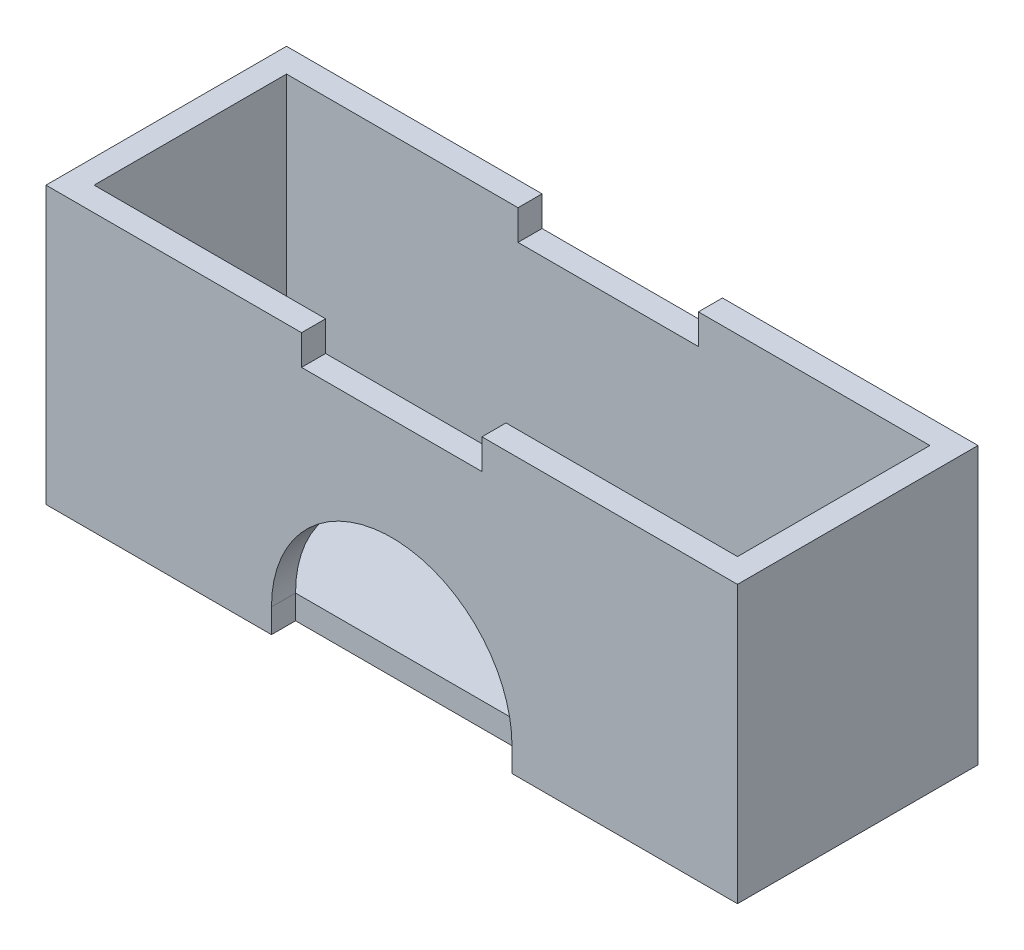
ISO-10303-21;
HEADER;
FILE_DESCRIPTION(('STEP AP214'),'2;1');
FILE_NAME('part.step','',(''),(''),'','','');
FILE_SCHEMA(('AUTOMOTIVE_DESIGN { 1 0 10303 214 1 1 1 1 }'));
ENDSEC;
DATA;
#1=APPLICATION_CONTEXT('core data for automotive mechanical design processes');
#2=APPLICATION_PROTOCOL_DEFINITION('international standard','automotive_design',2000,#1);
#3=PRODUCT_CONTEXT('',#1,'mechanical');
#4=PRODUCT('Part','Part','',(#3));
#5=PRODUCT_RELATED_PRODUCT_CATEGORY('part','',(#4));
#6=PRODUCT_DEFINITION_FORMATION('','',#4);
#7=PRODUCT_DEFINITION_CONTEXT('part definition',#1,'design');
#8=PRODUCT_DEFINITION('design','',#6,#7);
#9=PRODUCT_DEFINITION_SHAPE('','',#8);
#10=(LENGTH_UNIT() NAMED_UNIT(*) SI_UNIT(.MILLI.,.METRE.));
#11=(NAMED_UNIT(*) PLANE_ANGLE_UNIT() SI_UNIT($,.RADIAN.));
#12=(NAMED_UNIT(*) SI_UNIT($,.STERADIAN.) SOLID_ANGLE_UNIT());
#13=UNCERTAINTY_MEASURE_WITH_UNIT(LENGTH_MEASURE(1.E-05),#10,'distance_accuracy_value','');
#14=(GEOMETRIC_REPRESENTATION_CONTEXT(3) GLOBAL_UNCERTAINTY_ASSIGNED_CONTEXT((#13)) GLOBAL_UNIT_ASSIGNED_CONTEXT((#10,
#11,#12)) REPRESENTATION_CONTEXT('',''));
#15=CARTESIAN_POINT('',(0.,0.,0.));
#16=DIRECTION('',(0.,0.,1.));
#17=DIRECTION('',(1.,0.,0.));
#18=AXIS2_PLACEMENT_3D('',#15,#16,#17);
#19=CARTESIAN_POINT('',(0.,58.42,0.));
#20=DIRECTION('',(0.,-1.,0.));
#21=DIRECTION('',(0.,0.,-1.));
#22=AXIS2_PLACEMENT_3D('',#19,#20,#21);
#23=PLANE('',#22);
#24=DIRECTION('',(1.,0.,0.));
#25=VECTOR('',#24,1.);
#26=CARTESIAN_POINT('',(0.,58.42,0.));
#27=LINE('',#26,#25);
#28=CARTESIAN_POINT('',(0.,58.42,0.));
#29=VERTEX_POINT('',#28);
#30=CARTESIAN_POINT('',(53.975,58.42,0.));
#31=VERTEX_POINT('',#30);
#32=EDGE_CURVE('E283',#29,#31,#27,.T.);
#33=ORIENTED_EDGE('',*,*,#32,.T.);
#34=DIRECTION('',(0.,0.,1.));
#35=VECTOR('',#34,1.);
#36=CARTESIAN_POINT('',(53.975,58.42,-50.8));
#37=LINE('',#36,#35);
#38=CARTESIAN_POINT('',(53.975,58.42,-5.08));
#39=VERTEX_POINT('',#38);
#40=EDGE_CURVE('E183',#39,#31,#37,.T.);
#41=ORIENTED_EDGE('',*,*,#40,.F.);
#42=DIRECTION('',(1.,0.,0.));
#43=VECTOR('',#42,1.);
#44=CARTESIAN_POINT('',(0.,58.42,-5.08));
#45=LINE('',#44,#43);
#46=CARTESIAN_POINT('',(5.08,58.42,-5.08));
#47=VERTEX_POINT('',#46);
#48=EDGE_CURVE('E269',#47,#39,#45,.T.);
#49=ORIENTED_EDGE('',*,*,#48,.F.);
#50=DIRECTION('',(0.,0.,1.));
#51=VECTOR('',#50,1.);
#52=CARTESIAN_POINT('',(5.08,58.42,0.));
#53=LINE('',#52,#51);
#54=CARTESIAN_POINT('',(5.08,58.42,-45.72));
#55=VERTEX_POINT('',#54);
#56=EDGE_CURVE('E266',#55,#47,#53,.T.);
#57=ORIENTED_EDGE('',*,*,#56,.F.);
#58=DIRECTION('',(-1.,0.,0.));
#59=VECTOR('',#58,1.);
#60=CARTESIAN_POINT('',(0.,58.42,-45.72));
#61=LINE('',#60,#59);
#62=CARTESIAN_POINT('',(53.975,58.42,-45.72));
#63=VERTEX_POINT('',#62);
#64=EDGE_CURVE('E275',#63,#55,#61,.T.);
#65=ORIENTED_EDGE('',*,*,#64,.F.);
#66=CARTESIAN_POINT('',(53.975,58.42,-50.8));
#67=VERTEX_POINT('',#66);
#68=EDGE_CURVE('E196',#67,#63,#37,.T.);
#69=ORIENTED_EDGE('',*,*,#68,.F.);
#70=DIRECTION('',(-1.,0.,0.));
#71=VECTOR('',#70,1.);
#72=CARTESIAN_POINT('',(0.,58.42,-50.8));
#73=LINE('',#72,#71);
#74=CARTESIAN_POINT('',(0.,58.42,-50.8));
#75=VERTEX_POINT('',#74);
#76=EDGE_CURVE('E287',#67,#75,#73,.T.);
#77=ORIENTED_EDGE('',*,*,#76,.T.);
#78=DIRECTION('',(0.,0.,1.));
#79=VECTOR('',#78,1.);
#80=CARTESIAN_POINT('',(0.,58.42,0.));
#81=LINE('',#80,#79);
#82=EDGE_CURVE('E278',#75,#29,#81,.T.);
#83=ORIENTED_EDGE('',*,*,#82,.T.);
#84=EDGE_LOOP('',(#33,#41,#49,#57,#65,#69,#77,#83));
#85=FACE_BOUND('',#84,.T.);
#86=ADVANCED_FACE('F33',(#85),#23,.F.);
#87=CARTESIAN_POINT('',(0.,58.42,0.));
#88=DIRECTION('',(0.,0.,-1.));
#89=DIRECTION('',(-1.,0.,0.));
#90=AXIS2_PLACEMENT_3D('',#87,#88,#89);
#91=PLANE('',#90);
#92=DIRECTION('',(1.,0.,0.));
#93=VECTOR('',#92,1.);
#94=CARTESIAN_POINT('',(53.975,52.07,0.));
#95=LINE('',#94,#93);
#96=CARTESIAN_POINT('',(53.975,52.07,0.));
#97=VERTEX_POINT('',#96);
#98=CARTESIAN_POINT('',(92.075,52.07,0.));
#99=VERTEX_POINT('',#98);
#100=EDGE_CURVE('E171',#97,#99,#95,.T.);
#101=ORIENTED_EDGE('',*,*,#100,.F.);
#102=DIRECTION('',(0.,1.,0.));
#103=VECTOR('',#102,1.);
#104=CARTESIAN_POINT('',(53.975,52.07,0.));
#105=LINE('',#104,#103);
#106=EDGE_CURVE('E180',#97,#31,#105,.T.);
#107=ORIENTED_EDGE('',*,*,#106,.T.);
#108=ORIENTED_EDGE('',*,*,#32,.F.);
#109=DIRECTION('',(0.,-1.,0.));
#110=VECTOR('',#109,1.);
#111=CARTESIAN_POINT('',(0.,58.42,0.));
#112=LINE('',#111,#110);
#113=CARTESIAN_POINT('',(0.,0.,0.));
#114=VERTEX_POINT('',#113);
#115=EDGE_CURVE('E309',#29,#114,#112,.T.);
#116=ORIENTED_EDGE('',*,*,#115,.T.);
#117=DIRECTION('',(1.,0.,0.));
#118=VECTOR('',#117,1.);
#119=CARTESIAN_POINT('',(0.,0.,0.));
#120=LINE('',#119,#118);
#121=CARTESIAN_POINT('',(47.625,0.,0.));
#122=VERTEX_POINT('',#121);
#123=EDGE_CURVE('E295',#114,#122,#120,.T.);
#124=ORIENTED_EDGE('',*,*,#123,.T.);
#125=DIRECTION('',(0.,1.,0.));
#126=VECTOR('',#125,1.);
#127=CARTESIAN_POINT('',(47.625,0.,0.));
#128=LINE('',#127,#126);
#129=CARTESIAN_POINT('',(47.625,5.08,0.));
#130=VERTEX_POINT('',#129);
#131=EDGE_CURVE('E215',#122,#130,#128,.T.);
#132=ORIENTED_EDGE('',*,*,#131,.T.);
#133=CARTESIAN_POINT('',(73.025,5.08,0.));
#134=DIRECTION('',(0.,0.,1.));
#135=DIRECTION('',(1.,0.,0.));
#136=AXIS2_PLACEMENT_3D('',#133,#134,#135);
#137=CIRCLE('',#136,25.4);
#138=CARTESIAN_POINT('',(98.425,5.08,0.));
#139=VERTEX_POINT('',#138);
#140=EDGE_CURVE('E227',#130,#139,#137,.F.);
#141=ORIENTED_EDGE('',*,*,#140,.T.);
#142=DIRECTION('',(0.,1.,0.));
#143=VECTOR('',#142,1.);
#144=CARTESIAN_POINT('',(98.425,0.,0.));
#145=LINE('',#144,#143);
#146=CARTESIAN_POINT('',(98.425,0.,0.));
#147=VERTEX_POINT('',#146);
#148=EDGE_CURVE('E211',#147,#139,#145,.T.);
#149=ORIENTED_EDGE('',*,*,#148,.F.);
#150=CARTESIAN_POINT('',(146.05,0.,0.));
#151=VERTEX_POINT('',#150);
#152=EDGE_CURVE('E294',#147,#151,#120,.T.);
#153=ORIENTED_EDGE('',*,*,#152,.T.);
#154=DIRECTION('',(0.,-1.,0.));
#155=VECTOR('',#154,1.);
#156=CARTESIAN_POINT('',(146.05,58.42,0.));
#157=LINE('',#156,#155);
#158=CARTESIAN_POINT('',(146.05,58.42,0.));
#159=VERTEX_POINT('',#158);
#160=EDGE_CURVE('E306',#159,#151,#157,.T.);
#161=ORIENTED_EDGE('',*,*,#160,.F.);
#162=CARTESIAN_POINT('',(92.075,58.42,0.));
#163=VERTEX_POINT('',#162);
#164=EDGE_CURVE('E281',#163,#159,#27,.T.);
#165=ORIENTED_EDGE('',*,*,#164,.F.);
#166=DIRECTION('',(0.,1.,0.));
#167=VECTOR('',#166,1.);
#168=CARTESIAN_POINT('',(92.075,52.07,0.));
#169=LINE('',#168,#167);
#170=EDGE_CURVE('E186',#99,#163,#169,.T.);
#171=ORIENTED_EDGE('',*,*,#170,.F.);
#172=EDGE_LOOP('',(#101,#107,#108,#116,#124,#132,#141,#149,#153,#161,#165,#171));
#173=FACE_BOUND('',#172,.T.);
#174=ADVANCED_FACE('F189',(#173),#91,.F.);
#175=CARTESIAN_POINT('',(146.05,58.42,-50.8));
#176=VERTEX_POINT('',#175);
#177=CARTESIAN_POINT('',(92.075,58.42,-50.8));
#178=VERTEX_POINT('',#177);
#179=EDGE_CURVE('E288',#176,#178,#73,.T.);
#180=ORIENTED_EDGE('',*,*,#179,.T.);
#181=DIRECTION('',(0.,0.,-1.));
#182=VECTOR('',#181,1.);
#183=CARTESIAN_POINT('',(92.075,58.42,-50.8));
#184=LINE('',#183,#182);
#185=CARTESIAN_POINT('',(92.075,58.42,-45.72));
#186=VERTEX_POINT('',#185);
#187=EDGE_CURVE('E198',#186,#178,#184,.T.);
#188=ORIENTED_EDGE('',*,*,#187,.F.);
#189=CARTESIAN_POINT('',(140.97,58.42,-45.72));
#190=VERTEX_POINT('',#189);
#191=EDGE_CURVE('E253',#190,#186,#61,.T.);
#192=ORIENTED_EDGE('',*,*,#191,.F.);
#193=DIRECTION('',(0.,0.,-1.));
#194=VECTOR('',#193,1.);
#195=CARTESIAN_POINT('',(140.97,58.42,0.));
#196=LINE('',#195,#194);
#197=CARTESIAN_POINT('',(140.97,58.42,-5.08));
#198=VERTEX_POINT('',#197);
#199=EDGE_CURVE('E272',#198,#190,#196,.T.);
#200=ORIENTED_EDGE('',*,*,#199,.F.);
#201=CARTESIAN_POINT('',(92.075,58.42,-5.08));
#202=VERTEX_POINT('',#201);
#203=EDGE_CURVE('E268',#202,#198,#45,.T.);
#204=ORIENTED_EDGE('',*,*,#203,.F.);
#205=EDGE_CURVE('E177',#163,#202,#184,.T.);
#206=ORIENTED_EDGE('',*,*,#205,.F.);
#207=ORIENTED_EDGE('',*,*,#164,.T.);
#208=DIRECTION('',(0.,0.,-1.));
#209=VECTOR('',#208,1.);
#210=CARTESIAN_POINT('',(146.05,58.42,0.));
#211=LINE('',#210,#209);
#212=EDGE_CURVE('E285',#159,#176,#211,.T.);
#213=ORIENTED_EDGE('',*,*,#212,.T.);
#214=EDGE_LOOP('',(#180,#188,#192,#200,#204,#206,#207,#213));
#215=FACE_BOUND('',#214,.T.);
#216=ADVANCED_FACE('F323',(#215),#23,.F.);
#217=CARTESIAN_POINT('',(0.,58.42,0.));
#218=DIRECTION('',(1.,0.,0.));
#219=DIRECTION('',(0.,0.,-1.));
#220=AXIS2_PLACEMENT_3D('',#217,#218,#219);
#221=PLANE('',#220);
#222=DIRECTION('',(0.,0.,1.));
#223=VECTOR('',#222,1.);
#224=CARTESIAN_POINT('',(0.,0.,0.));
#225=LINE('',#224,#223);
#226=CARTESIAN_POINT('',(0.,0.,-50.8));
#227=VERTEX_POINT('',#226);
#228=EDGE_CURVE('E247',#227,#114,#225,.T.);
#229=ORIENTED_EDGE('',*,*,#228,.T.);
#230=ORIENTED_EDGE('',*,*,#115,.F.);
#231=ORIENTED_EDGE('',*,*,#82,.F.);
#232=DIRECTION('',(0.,-1.,0.));
#233=VECTOR('',#232,1.);
#234=CARTESIAN_POINT('',(0.,58.42,-50.8));
#235=LINE('',#234,#233);
#236=EDGE_CURVE('E291',#75,#227,#235,.T.);
#237=ORIENTED_EDGE('',*,*,#236,.T.);
#238=EDGE_LOOP('',(#229,#230,#231,#237));
#239=FACE_BOUND('',#238,.T.);
#240=ADVANCED_FACE('F35',(#239),#221,.F.);
#241=CARTESIAN_POINT('',(146.05,58.42,0.));
#242=DIRECTION('',(-1.,0.,0.));
#243=DIRECTION('',(0.,0.,1.));
#244=AXIS2_PLACEMENT_3D('',#241,#242,#243);
#245=PLANE('',#244);
#246=DIRECTION('',(0.,0.,-1.));
#247=VECTOR('',#246,1.);
#248=CARTESIAN_POINT('',(146.05,0.,0.));
#249=LINE('',#248,#247);
#250=CARTESIAN_POINT('',(146.05,0.,-50.8));
#251=VERTEX_POINT('',#250);
#252=EDGE_CURVE('E298',#151,#251,#249,.T.);
#253=ORIENTED_EDGE('',*,*,#252,.T.);
#254=DIRECTION('',(0.,-1.,0.));
#255=VECTOR('',#254,1.);
#256=CARTESIAN_POINT('',(146.05,58.42,-50.8));
#257=LINE('',#256,#255);
#258=EDGE_CURVE('E303',#176,#251,#257,.T.);
#259=ORIENTED_EDGE('',*,*,#258,.F.);
#260=ORIENTED_EDGE('',*,*,#212,.F.);
#261=ORIENTED_EDGE('',*,*,#160,.T.);
#262=EDGE_LOOP('',(#253,#259,#260,#261));
#263=FACE_BOUND('',#262,.T.);
#264=ADVANCED_FACE('F366',(#263),#245,.F.);
#265=CARTESIAN_POINT('',(0.,58.42,-50.8));
#266=DIRECTION('',(0.,0.,1.));
#267=DIRECTION('',(1.,0.,0.));
#268=AXIS2_PLACEMENT_3D('',#265,#266,#267);
#269=PLANE('',#268);
#270=ORIENTED_EDGE('',*,*,#76,.F.);
#271=DIRECTION('',(0.,1.,0.));
#272=VECTOR('',#271,1.);
#273=CARTESIAN_POINT('',(53.975,52.07,-50.8));
#274=LINE('',#273,#272);
#275=CARTESIAN_POINT('',(53.975,52.07,-50.8));
#276=VERTEX_POINT('',#275);
#277=EDGE_CURVE('E200',#276,#67,#274,.T.);
#278=ORIENTED_EDGE('',*,*,#277,.F.);
#279=DIRECTION('',(-1.,0.,0.));
#280=VECTOR('',#279,1.);
#281=CARTESIAN_POINT('',(53.975,52.07,-50.8));
#282=LINE('',#281,#280);
#283=CARTESIAN_POINT('',(92.075,52.07,-50.8));
#284=VERTEX_POINT('',#283);
#285=EDGE_CURVE('E187',#284,#276,#282,.T.);
#286=ORIENTED_EDGE('',*,*,#285,.F.);
#287=DIRECTION('',(0.,1.,0.));
#288=VECTOR('',#287,1.);
#289=CARTESIAN_POINT('',(92.075,52.07,-50.8));
#290=LINE('',#289,#288);
#291=EDGE_CURVE('E202',#284,#178,#290,.T.);
#292=ORIENTED_EDGE('',*,*,#291,.T.);
#293=ORIENTED_EDGE('',*,*,#179,.F.);
#294=ORIENTED_EDGE('',*,*,#258,.T.);
#295=DIRECTION('',(-1.,0.,0.));
#296=VECTOR('',#295,1.);
#297=CARTESIAN_POINT('',(0.,0.,-50.8));
#298=LINE('',#297,#296);
#299=EDGE_CURVE('E282',#251,#227,#298,.T.);
#300=ORIENTED_EDGE('',*,*,#299,.T.);
#301=ORIENTED_EDGE('',*,*,#236,.F.);
#302=EDGE_LOOP('',(#270,#278,#286,#292,#293,#294,#300,#301));
#303=FACE_BOUND('',#302,.T.);
#304=ADVANCED_FACE('F371',(#303),#269,.F.);
#305=CARTESIAN_POINT('',(0.,0.,0.));
#306=DIRECTION('',(0.,-1.,0.));
#307=DIRECTION('',(0.,0.,-1.));
#308=AXIS2_PLACEMENT_3D('',#305,#306,#307);
#309=PLANE('',#308);
#310=DIRECTION('',(0.,0.,1.));
#311=VECTOR('',#310,1.);
#312=CARTESIAN_POINT('',(98.425,0.,-5.08));
#313=LINE('',#312,#311);
#314=CARTESIAN_POINT('',(98.425,0.,-5.08));
#315=VERTEX_POINT('',#314);
#316=EDGE_CURVE('E232',#315,#147,#313,.T.);
#317=ORIENTED_EDGE('',*,*,#316,.F.);
#318=DIRECTION('',(1.,0.,0.));
#319=VECTOR('',#318,1.);
#320=CARTESIAN_POINT('',(0.,0.,-5.08));
#321=LINE('',#320,#319);
#322=CARTESIAN_POINT('',(47.625,0.,-5.08));
#323=VERTEX_POINT('',#322);
#324=EDGE_CURVE('E221',#323,#315,#321,.T.);
#325=ORIENTED_EDGE('',*,*,#324,.F.);
#326=DIRECTION('',(0.,0.,1.));
#327=VECTOR('',#326,1.);
#328=CARTESIAN_POINT('',(47.625,0.,-5.08));
#329=LINE('',#328,#327);
#330=EDGE_CURVE('E235',#323,#122,#329,.T.);
#331=ORIENTED_EDGE('',*,*,#330,.T.);
#332=ORIENTED_EDGE('',*,*,#123,.F.);
#333=ORIENTED_EDGE('',*,*,#228,.F.);
#334=ORIENTED_EDGE('',*,*,#299,.F.);
#335=ORIENTED_EDGE('',*,*,#252,.F.);
#336=ORIENTED_EDGE('',*,*,#152,.F.);
#337=EDGE_LOOP('',(#317,#325,#331,#332,#333,#334,#335,#336));
#338=FACE_BOUND('',#337,.T.);
#339=ADVANCED_FACE('F381',(#338),#309,.T.);
#340=CARTESIAN_POINT('',(5.08,58.42,0.));
#341=DIRECTION('',(1.,0.,0.));
#342=DIRECTION('',(0.,0.,-1.));
#343=AXIS2_PLACEMENT_3D('',#340,#341,#342);
#344=PLANE('',#343);
#345=DIRECTION('',(0.,0.,1.));
#346=VECTOR('',#345,1.);
#347=CARTESIAN_POINT('',(5.08,5.08,0.));
#348=LINE('',#347,#346);
#349=CARTESIAN_POINT('',(5.08,5.08,-45.72));
#350=VERTEX_POINT('',#349);
#351=CARTESIAN_POINT('',(5.08,5.08,-5.08));
#352=VERTEX_POINT('',#351);
#353=EDGE_CURVE('E234',#350,#352,#348,.T.);
#354=ORIENTED_EDGE('',*,*,#353,.F.);
#355=DIRECTION('',(0.,-1.,0.));
#356=VECTOR('',#355,1.);
#357=CARTESIAN_POINT('',(5.08,58.42,-45.72));
#358=LINE('',#357,#356);
#359=EDGE_CURVE('E249',#55,#350,#358,.T.);
#360=ORIENTED_EDGE('',*,*,#359,.F.);
#361=ORIENTED_EDGE('',*,*,#56,.T.);
#362=DIRECTION('',(0.,-1.,0.));
#363=VECTOR('',#362,1.);
#364=CARTESIAN_POINT('',(5.08,58.42,-5.08));
#365=LINE('',#364,#363);
#366=EDGE_CURVE('E244',#47,#352,#365,.T.);
#367=ORIENTED_EDGE('',*,*,#366,.T.);
#368=EDGE_LOOP('',(#354,#360,#361,#367));
#369=FACE_BOUND('',#368,.T.);
#370=ADVANCED_FACE('F414',(#369),#344,.T.);
#371=CARTESIAN_POINT('',(0.,58.42,-5.08));
#372=DIRECTION('',(0.,0.,-1.));
#373=DIRECTION('',(-1.,0.,0.));
#374=AXIS2_PLACEMENT_3D('',#371,#372,#373);
#375=PLANE('',#374);
#376=DIRECTION('',(0.,1.,0.));
#377=VECTOR('',#376,1.);
#378=CARTESIAN_POINT('',(53.975,58.42,-5.08));
#379=LINE('',#378,#377);
#380=CARTESIAN_POINT('',(53.975,52.07,-5.08));
#381=VERTEX_POINT('',#380);
#382=EDGE_CURVE('E209',#381,#39,#379,.T.);
#383=ORIENTED_EDGE('',*,*,#382,.F.);
#384=DIRECTION('',(1.,0.,0.));
#385=VECTOR('',#384,1.);
#386=CARTESIAN_POINT('',(0.,52.07,-5.08));
#387=LINE('',#386,#385);
#388=CARTESIAN_POINT('',(92.075,52.07,-5.08));
#389=VERTEX_POINT('',#388);
#390=EDGE_CURVE('E174',#381,#389,#387,.T.);
#391=ORIENTED_EDGE('',*,*,#390,.T.);
#392=DIRECTION('',(0.,-1.,0.));
#393=VECTOR('',#392,1.);
#394=CARTESIAN_POINT('',(92.075,58.42,-5.08));
#395=LINE('',#394,#393);
#396=EDGE_CURVE('E207',#202,#389,#395,.T.);
#397=ORIENTED_EDGE('',*,*,#396,.F.);
#398=ORIENTED_EDGE('',*,*,#203,.T.);
#399=DIRECTION('',(0.,-1.,0.));
#400=VECTOR('',#399,1.);
#401=CARTESIAN_POINT('',(140.97,58.42,-5.08));
#402=LINE('',#401,#400);
#403=CARTESIAN_POINT('',(140.97,5.08,-5.08));
#404=VERTEX_POINT('',#403);
#405=EDGE_CURVE('E248',#198,#404,#402,.T.);
#406=ORIENTED_EDGE('',*,*,#405,.T.);
#407=DIRECTION('',(1.,0.,0.));
#408=VECTOR('',#407,1.);
#409=CARTESIAN_POINT('',(0.,5.08,-5.08));
#410=LINE('',#409,#408);
#411=CARTESIAN_POINT('',(98.425,5.08,-5.08));
#412=VERTEX_POINT('',#411);
#413=EDGE_CURVE('E243',#412,#404,#410,.T.);
#414=ORIENTED_EDGE('',*,*,#413,.F.);
#415=CARTESIAN_POINT('',(73.025,5.08,-5.08));
#416=DIRECTION('',(0.,0.,1.));
#417=DIRECTION('',(1.,0.,0.));
#418=AXIS2_PLACEMENT_3D('',#415,#416,#417);
#419=CIRCLE('',#418,25.4);
#420=CARTESIAN_POINT('',(47.625,5.08,-5.08));
#421=VERTEX_POINT('',#420);
#422=EDGE_CURVE('E214',#421,#412,#419,.F.);
#423=ORIENTED_EDGE('',*,*,#422,.F.);
#424=EDGE_CURVE('E254',#352,#421,#410,.T.);
#425=ORIENTED_EDGE('',*,*,#424,.F.);
#426=ORIENTED_EDGE('',*,*,#366,.F.);
#427=ORIENTED_EDGE('',*,*,#48,.T.);
#428=EDGE_LOOP('',(#383,#391,#397,#398,#406,#414,#423,#425,#426,#427));
#429=FACE_BOUND('',#428,.T.);
#430=ADVANCED_FACE('F337',(#429),#375,.T.);
#431=CARTESIAN_POINT('',(140.97,58.42,0.));
#432=DIRECTION('',(-1.,0.,0.));
#433=DIRECTION('',(0.,0.,1.));
#434=AXIS2_PLACEMENT_3D('',#431,#432,#433);
#435=PLANE('',#434);
#436=DIRECTION('',(0.,0.,-1.));
#437=VECTOR('',#436,1.);
#438=CARTESIAN_POINT('',(140.97,5.08,0.));
#439=LINE('',#438,#437);
#440=CARTESIAN_POINT('',(140.97,5.08,-45.72));
#441=VERTEX_POINT('',#440);
#442=EDGE_CURVE('E257',#404,#441,#439,.T.);
#443=ORIENTED_EDGE('',*,*,#442,.F.);
#444=ORIENTED_EDGE('',*,*,#405,.F.);
#445=ORIENTED_EDGE('',*,*,#199,.T.);
#446=DIRECTION('',(0.,-1.,0.));
#447=VECTOR('',#446,1.);
#448=CARTESIAN_POINT('',(140.97,58.42,-45.72));
#449=LINE('',#448,#447);
#450=EDGE_CURVE('E252',#190,#441,#449,.T.);
#451=ORIENTED_EDGE('',*,*,#450,.T.);
#452=EDGE_LOOP('',(#443,#444,#445,#451));
#453=FACE_BOUND('',#452,.T.);
#454=ADVANCED_FACE('F332',(#453),#435,.T.);
#455=CARTESIAN_POINT('',(0.,58.42,-45.72));
#456=DIRECTION('',(0.,0.,1.));
#457=DIRECTION('',(1.,0.,0.));
#458=AXIS2_PLACEMENT_3D('',#455,#456,#457);
#459=PLANE('',#458);
#460=DIRECTION('',(0.,-1.,0.));
#461=VECTOR('',#460,1.);
#462=CARTESIAN_POINT('',(53.975,58.42,-45.72));
#463=LINE('',#462,#461);
#464=CARTESIAN_POINT('',(53.975,52.07,-45.72));
#465=VERTEX_POINT('',#464);
#466=EDGE_CURVE('E11',#63,#465,#463,.T.);
#467=ORIENTED_EDGE('',*,*,#466,.F.);
#468=ORIENTED_EDGE('',*,*,#64,.T.);
#469=ORIENTED_EDGE('',*,*,#359,.T.);
#470=DIRECTION('',(-1.,0.,0.));
#471=VECTOR('',#470,1.);
#472=CARTESIAN_POINT('',(0.,5.08,-45.72));
#473=LINE('',#472,#471);
#474=EDGE_CURVE('E262',#441,#350,#473,.T.);
#475=ORIENTED_EDGE('',*,*,#474,.F.);
#476=ORIENTED_EDGE('',*,*,#450,.F.);
#477=ORIENTED_EDGE('',*,*,#191,.T.);
#478=DIRECTION('',(0.,1.,0.));
#479=VECTOR('',#478,1.);
#480=CARTESIAN_POINT('',(92.075,58.42,-45.72));
#481=LINE('',#480,#479);
#482=CARTESIAN_POINT('',(92.075,52.07,-45.72));
#483=VERTEX_POINT('',#482);
#484=EDGE_CURVE('E41',#483,#186,#481,.T.);
#485=ORIENTED_EDGE('',*,*,#484,.F.);
#486=DIRECTION('',(-1.,0.,0.));
#487=VECTOR('',#486,1.);
#488=CARTESIAN_POINT('',(0.,52.07,-45.72));
#489=LINE('',#488,#487);
#490=EDGE_CURVE('E312',#483,#465,#489,.T.);
#491=ORIENTED_EDGE('',*,*,#490,.T.);
#492=EDGE_LOOP('',(#467,#468,#469,#475,#476,#477,#485,#491));
#493=FACE_BOUND('',#492,.T.);
#494=ADVANCED_FACE('F327',(#493),#459,.T.);
#495=CARTESIAN_POINT('',(0.,5.08,0.));
#496=DIRECTION('',(0.,-1.,0.));
#497=DIRECTION('',(0.,0.,-1.));
#498=AXIS2_PLACEMENT_3D('',#495,#496,#497);
#499=PLANE('',#498);
#500=ORIENTED_EDGE('',*,*,#353,.T.);
#501=ORIENTED_EDGE('',*,*,#424,.T.);
#502=EDGE_CURVE('E258',#421,#412,#410,.T.);
#503=ORIENTED_EDGE('',*,*,#502,.T.);
#504=ORIENTED_EDGE('',*,*,#413,.T.);
#505=ORIENTED_EDGE('',*,*,#442,.T.);
#506=ORIENTED_EDGE('',*,*,#474,.T.);
#507=EDGE_LOOP('',(#500,#501,#503,#504,#505,#506));
#508=FACE_BOUND('',#507,.T.);
#509=ADVANCED_FACE('F409',(#508),#499,.F.);
#510=CARTESIAN_POINT('',(0.,0.,-5.08));
#511=DIRECTION('',(0.,0.,1.));
#512=DIRECTION('',(1.,0.,0.));
#513=AXIS2_PLACEMENT_3D('',#510,#511,#512);
#514=PLANE('',#513);
#515=ORIENTED_EDGE('',*,*,#502,.F.);
#516=DIRECTION('',(0.,1.,0.));
#517=VECTOR('',#516,1.);
#518=CARTESIAN_POINT('',(47.625,0.,-5.08));
#519=LINE('',#518,#517);
#520=EDGE_CURVE('E218',#323,#421,#519,.T.);
#521=ORIENTED_EDGE('',*,*,#520,.F.);
#522=ORIENTED_EDGE('',*,*,#324,.T.);
#523=DIRECTION('',(0.,1.,0.));
#524=VECTOR('',#523,1.);
#525=CARTESIAN_POINT('',(98.425,0.,-5.08));
#526=LINE('',#525,#524);
#527=EDGE_CURVE('E212',#315,#412,#526,.T.);
#528=ORIENTED_EDGE('',*,*,#527,.T.);
#529=EDGE_LOOP('',(#515,#521,#522,#528));
#530=FACE_BOUND('',#529,.T.);
#531=ADVANCED_FACE('F400',(#530),#514,.T.);
#532=CARTESIAN_POINT('',(98.425,0.,-5.08));
#533=DIRECTION('',(1.,0.,0.));
#534=DIRECTION('',(0.,0.,-1.));
#535=AXIS2_PLACEMENT_3D('',#532,#533,#534);
#536=PLANE('',#535);
#537=ORIENTED_EDGE('',*,*,#148,.T.);
#538=DIRECTION('',(0.,0.,1.));
#539=VECTOR('',#538,1.);
#540=CARTESIAN_POINT('',(98.425,5.08,-5.08));
#541=LINE('',#540,#539);
#542=EDGE_CURVE('E224',#412,#139,#541,.T.);
#543=ORIENTED_EDGE('',*,*,#542,.F.);
#544=ORIENTED_EDGE('',*,*,#527,.F.);
#545=ORIENTED_EDGE('',*,*,#316,.T.);
#546=EDGE_LOOP('',(#537,#543,#544,#545));
#547=FACE_BOUND('',#546,.T.);
#548=ADVANCED_FACE('F398',(#547),#536,.F.);
#549=CARTESIAN_POINT('',(47.625,0.,-5.08));
#550=DIRECTION('',(1.,0.,0.));
#551=DIRECTION('',(0.,0.,-1.));
#552=AXIS2_PLACEMENT_3D('',#549,#550,#551);
#553=PLANE('',#552);
#554=ORIENTED_EDGE('',*,*,#131,.F.);
#555=ORIENTED_EDGE('',*,*,#330,.F.);
#556=ORIENTED_EDGE('',*,*,#520,.T.);
#557=DIRECTION('',(0.,0.,1.));
#558=VECTOR('',#557,1.);
#559=CARTESIAN_POINT('',(47.625,5.08,-5.08));
#560=LINE('',#559,#558);
#561=EDGE_CURVE('E238',#421,#130,#560,.T.);
#562=ORIENTED_EDGE('',*,*,#561,.T.);
#563=EDGE_LOOP('',(#554,#555,#556,#562));
#564=FACE_BOUND('',#563,.T.);
#565=ADVANCED_FACE('F404',(#564),#553,.T.);
#566=CARTESIAN_POINT('',(73.025,5.08,-5.08));
#567=DIRECTION('',(0.,0.,1.));
#568=DIRECTION('',(1.,0.,0.));
#569=AXIS2_PLACEMENT_3D('',#566,#567,#568);
#570=CYLINDRICAL_SURFACE('',#569,25.4);
#571=ORIENTED_EDGE('',*,*,#140,.F.);
#572=ORIENTED_EDGE('',*,*,#561,.F.);
#573=ORIENTED_EDGE('',*,*,#422,.T.);
#574=ORIENTED_EDGE('',*,*,#542,.T.);
#575=EDGE_LOOP('',(#571,#572,#573,#574));
#576=FACE_BOUND('',#575,.T.);
#577=ADVANCED_FACE('F407',(#576),#570,.F.);
#578=CARTESIAN_POINT('',(0.,52.07,0.));
#579=DIRECTION('',(0.,1.,0.));
#580=DIRECTION('',(0.,0.,1.));
#581=AXIS2_PLACEMENT_3D('',#578,#579,#580);
#582=PLANE('',#581);
#583=DIRECTION('',(0.,0.,-1.));
#584=VECTOR('',#583,1.);
#585=CARTESIAN_POINT('',(92.075,52.07,-50.8));
#586=LINE('',#585,#584);
#587=EDGE_CURVE('E191',#483,#284,#586,.T.);
#588=ORIENTED_EDGE('',*,*,#587,.T.);
#589=ORIENTED_EDGE('',*,*,#285,.T.);
#590=DIRECTION('',(0.,0.,1.));
#591=VECTOR('',#590,1.);
#592=CARTESIAN_POINT('',(53.975,52.07,-50.8));
#593=LINE('',#592,#591);
#594=EDGE_CURVE('E56',#276,#465,#593,.T.);
#595=ORIENTED_EDGE('',*,*,#594,.T.);
#596=ORIENTED_EDGE('',*,*,#490,.F.);
#597=EDGE_LOOP('',(#588,#589,#595,#596));
#598=FACE_BOUND('',#597,.T.);
#599=ADVANCED_FACE('F348',(#598),#582,.T.);
#600=CARTESIAN_POINT('',(92.075,52.07,-50.8));
#601=DIRECTION('',(1.,0.,0.));
#602=DIRECTION('',(0.,0.,-1.));
#603=AXIS2_PLACEMENT_3D('',#600,#601,#602);
#604=PLANE('',#603);
#605=ORIENTED_EDGE('',*,*,#484,.T.);
#606=ORIENTED_EDGE('',*,*,#187,.T.);
#607=ORIENTED_EDGE('',*,*,#291,.F.);
#608=ORIENTED_EDGE('',*,*,#587,.F.);
#609=EDGE_LOOP('',(#605,#606,#607,#608));
#610=FACE_BOUND('',#609,.T.);
#611=ADVANCED_FACE('F318',(#610),#604,.F.);
#612=CARTESIAN_POINT('',(53.975,52.07,-50.8));
#613=DIRECTION('',(-1.,0.,0.));
#614=DIRECTION('',(0.,0.,1.));
#615=AXIS2_PLACEMENT_3D('',#612,#613,#614);
#616=PLANE('',#615);
#617=ORIENTED_EDGE('',*,*,#466,.T.);
#618=ORIENTED_EDGE('',*,*,#594,.F.);
#619=ORIENTED_EDGE('',*,*,#277,.T.);
#620=ORIENTED_EDGE('',*,*,#68,.T.);
#621=EDGE_LOOP('',(#617,#618,#619,#620));
#622=FACE_BOUND('',#621,.T.);
#623=ADVANCED_FACE('F349',(#622),#616,.F.);
#624=ORIENTED_EDGE('',*,*,#382,.T.);
#625=ORIENTED_EDGE('',*,*,#40,.T.);
#626=ORIENTED_EDGE('',*,*,#106,.F.);
#627=EDGE_CURVE('E167',#381,#97,#593,.T.);
#628=ORIENTED_EDGE('',*,*,#627,.F.);
#629=EDGE_LOOP('',(#624,#625,#626,#628));
#630=FACE_BOUND('',#629,.T.);
#631=ADVANCED_FACE('F181',(#630),#616,.F.);
#632=ORIENTED_EDGE('',*,*,#396,.T.);
#633=EDGE_CURVE('E48',#99,#389,#586,.T.);
#634=ORIENTED_EDGE('',*,*,#633,.F.);
#635=ORIENTED_EDGE('',*,*,#170,.T.);
#636=ORIENTED_EDGE('',*,*,#205,.T.);
#637=EDGE_LOOP('',(#632,#634,#635,#636));
#638=FACE_BOUND('',#637,.T.);
#639=ADVANCED_FACE('F340',(#638),#604,.F.);
#640=ORIENTED_EDGE('',*,*,#627,.T.);
#641=ORIENTED_EDGE('',*,*,#100,.T.);
#642=ORIENTED_EDGE('',*,*,#633,.T.);
#643=ORIENTED_EDGE('',*,*,#390,.F.);
#644=EDGE_LOOP('',(#640,#641,#642,#643));
#645=FACE_BOUND('',#644,.T.);
#646=ADVANCED_FACE('F169',(#645),#582,.T.);
#647=CLOSED_SHELL('',(#86,#174,#216,#240,#264,#304,#339,#370,#430,#454,#494,#509,#531,#548,#565,
#577,#599,#611,#623,#631,#639,#646));
#648=MANIFOLD_SOLID_BREP('B2',#647);
#649=ADVANCED_BREP_SHAPE_REPRESENTATION('',(#18,#648),#14);
#650=SHAPE_DEFINITION_REPRESENTATION(#9,#649);
ENDSEC;
END-ISO-10303-21;
